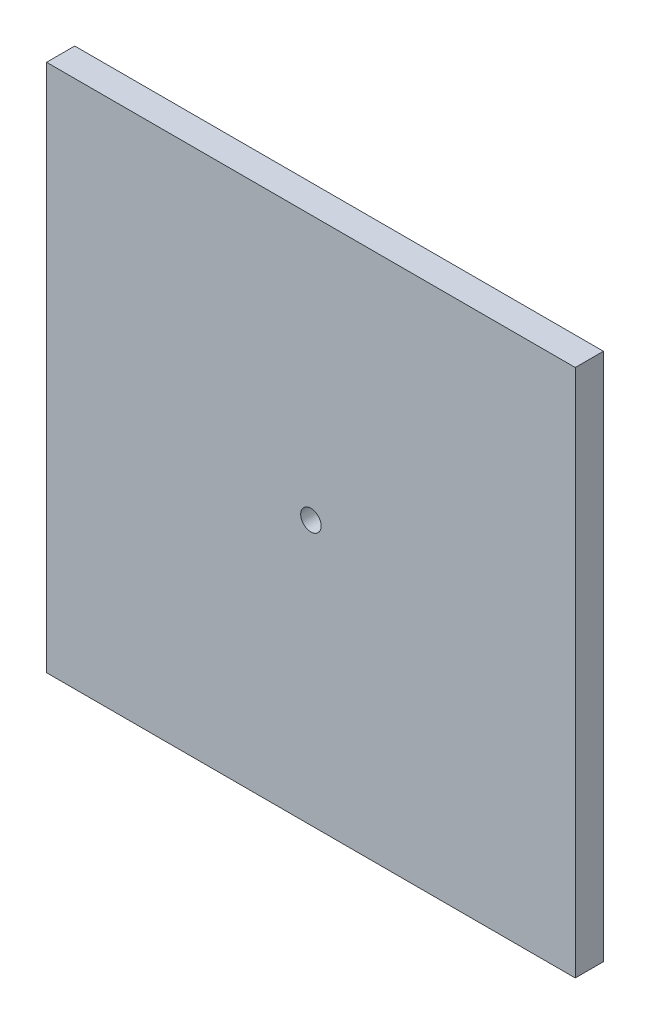
ISO-10303-21;
HEADER;
FILE_DESCRIPTION(('STEP AP214'),'2;1');
FILE_NAME('part.step','',(''),(''),'','','');
FILE_SCHEMA(('AUTOMOTIVE_DESIGN { 1 0 10303 214 1 1 1 1 }'));
ENDSEC;
DATA;
#1=APPLICATION_CONTEXT('core data for automotive mechanical design processes');
#2=APPLICATION_PROTOCOL_DEFINITION('international standard','automotive_design',2000,#1);
#3=PRODUCT_CONTEXT('',#1,'mechanical');
#4=PRODUCT('Part','Part','',(#3));
#5=PRODUCT_RELATED_PRODUCT_CATEGORY('part','',(#4));
#6=PRODUCT_DEFINITION_FORMATION('','',#4);
#7=PRODUCT_DEFINITION_CONTEXT('part definition',#1,'design');
#8=PRODUCT_DEFINITION('design','',#6,#7);
#9=PRODUCT_DEFINITION_SHAPE('','',#8);
#10=(LENGTH_UNIT() NAMED_UNIT(*) SI_UNIT(.MILLI.,.METRE.));
#11=(NAMED_UNIT(*) PLANE_ANGLE_UNIT() SI_UNIT($,.RADIAN.));
#12=(NAMED_UNIT(*) SI_UNIT($,.STERADIAN.) SOLID_ANGLE_UNIT());
#13=UNCERTAINTY_MEASURE_WITH_UNIT(LENGTH_MEASURE(1.E-05),#10,'distance_accuracy_value','');
#14=(GEOMETRIC_REPRESENTATION_CONTEXT(3) GLOBAL_UNCERTAINTY_ASSIGNED_CONTEXT((#13)) GLOBAL_UNIT_ASSIGNED_CONTEXT((#10,
#11,#12)) REPRESENTATION_CONTEXT('',''));
#15=CARTESIAN_POINT('',(0.,0.,0.));
#16=DIRECTION('',(0.,0.,1.));
#17=DIRECTION('',(1.,0.,0.));
#18=AXIS2_PLACEMENT_3D('',#15,#16,#17);
#19=CARTESIAN_POINT('',(81.9785,0.,8.73125));
#20=DIRECTION('',(1.,0.,0.));
#21=DIRECTION('',(0.,1.,0.));
#22=AXIS2_PLACEMENT_3D('',#19,#20,#21);
#23=PLANE('',#22);
#24=DIRECTION('',(0.,-1.,0.));
#25=VECTOR('',#24,1.);
#26=CARTESIAN_POINT('',(81.9785,0.,0.));
#27=LINE('',#26,#25);
#28=CARTESIAN_POINT('',(81.9785,81.9785,0.));
#29=VERTEX_POINT('',#28);
#30=CARTESIAN_POINT('',(81.9785,-81.9785,0.));
#31=VERTEX_POINT('',#30);
#32=EDGE_CURVE('E120',#29,#31,#27,.T.);
#33=ORIENTED_EDGE('',*,*,#32,.F.);
#34=DIRECTION('',(0.,0.,-1.));
#35=VECTOR('',#34,1.);
#36=CARTESIAN_POINT('',(81.9785,81.9785,8.73125));
#37=LINE('',#36,#35);
#38=CARTESIAN_POINT('',(81.9785,81.9785,8.73125));
#39=VERTEX_POINT('',#38);
#40=EDGE_CURVE('E11',#39,#29,#37,.T.);
#41=ORIENTED_EDGE('',*,*,#40,.F.);
#42=DIRECTION('',(0.,-1.,0.));
#43=VECTOR('',#42,1.);
#44=CARTESIAN_POINT('',(81.9785,0.,8.73125));
#45=LINE('',#44,#43);
#46=CARTESIAN_POINT('',(81.9785,-81.9785,8.73125));
#47=VERTEX_POINT('',#46);
#48=EDGE_CURVE('E106',#39,#47,#45,.T.);
#49=ORIENTED_EDGE('',*,*,#48,.T.);
#50=DIRECTION('',(0.,0.,-1.));
#51=VECTOR('',#50,1.);
#52=CARTESIAN_POINT('',(81.9785,-81.9785,8.73125));
#53=LINE('',#52,#51);
#54=EDGE_CURVE('E84',#47,#31,#53,.T.);
#55=ORIENTED_EDGE('',*,*,#54,.T.);
#56=EDGE_LOOP('',(#33,#41,#49,#55));
#57=FACE_BOUND('',#56,.T.);
#58=ADVANCED_FACE('F45',(#57),#23,.T.);
#59=CARTESIAN_POINT('',(0.,81.9785,8.73125));
#60=DIRECTION('',(0.,1.,0.));
#61=DIRECTION('',(0.,0.,1.));
#62=AXIS2_PLACEMENT_3D('',#59,#60,#61);
#63=PLANE('',#62);
#64=DIRECTION('',(1.,0.,0.));
#65=VECTOR('',#64,1.);
#66=CARTESIAN_POINT('',(0.,81.9785,0.));
#67=LINE('',#66,#65);
#68=CARTESIAN_POINT('',(-81.9785,81.9785,0.));
#69=VERTEX_POINT('',#68);
#70=EDGE_CURVE('E97',#69,#29,#67,.T.);
#71=ORIENTED_EDGE('',*,*,#70,.F.);
#72=DIRECTION('',(0.,0.,-1.));
#73=VECTOR('',#72,1.);
#74=CARTESIAN_POINT('',(-81.9785,81.9785,8.73125));
#75=LINE('',#74,#73);
#76=CARTESIAN_POINT('',(-81.9785,81.9785,8.73125));
#77=VERTEX_POINT('',#76);
#78=EDGE_CURVE('E54',#77,#69,#75,.T.);
#79=ORIENTED_EDGE('',*,*,#78,.F.);
#80=DIRECTION('',(1.,0.,0.));
#81=VECTOR('',#80,1.);
#82=CARTESIAN_POINT('',(0.,81.9785,8.73125));
#83=LINE('',#82,#81);
#84=EDGE_CURVE('E95',#77,#39,#83,.T.);
#85=ORIENTED_EDGE('',*,*,#84,.T.);
#86=ORIENTED_EDGE('',*,*,#40,.T.);
#87=EDGE_LOOP('',(#71,#79,#85,#86));
#88=FACE_BOUND('',#87,.T.);
#89=ADVANCED_FACE('F93',(#88),#63,.T.);
#90=CARTESIAN_POINT('',(-81.9785000000003,2.70616862252383E-13,8.73125));
#91=DIRECTION('',(1.,0.,0.));
#92=DIRECTION('',(0.,1.,0.));
#93=AXIS2_PLACEMENT_3D('',#90,#91,#92);
#94=PLANE('',#93);
#95=DIRECTION('',(0.,-1.,0.));
#96=VECTOR('',#95,1.);
#97=CARTESIAN_POINT('',(-81.9785000000003,2.70616862252383E-13,0.));
#98=LINE('',#97,#96);
#99=CARTESIAN_POINT('',(-81.9785000000005,-81.9785,0.));
#100=VERTEX_POINT('',#99);
#101=EDGE_CURVE('E77',#69,#100,#98,.T.);
#102=ORIENTED_EDGE('',*,*,#101,.T.);
#103=DIRECTION('',(0.,0.,-1.));
#104=VECTOR('',#103,1.);
#105=CARTESIAN_POINT('',(-81.9785000000005,-81.9785,8.73125));
#106=LINE('',#105,#104);
#107=CARTESIAN_POINT('',(-81.9785000000005,-81.9785,8.73125));
#108=VERTEX_POINT('',#107);
#109=EDGE_CURVE('E99',#108,#100,#106,.T.);
#110=ORIENTED_EDGE('',*,*,#109,.F.);
#111=DIRECTION('',(0.,-1.,0.));
#112=VECTOR('',#111,1.);
#113=CARTESIAN_POINT('',(-81.9785000000003,2.70616862252383E-13,8.73125));
#114=LINE('',#113,#112);
#115=EDGE_CURVE('E100',#77,#108,#114,.T.);
#116=ORIENTED_EDGE('',*,*,#115,.F.);
#117=ORIENTED_EDGE('',*,*,#78,.T.);
#118=EDGE_LOOP('',(#102,#110,#116,#117));
#119=FACE_BOUND('',#118,.T.);
#120=ADVANCED_FACE('F101',(#119),#94,.F.);
#121=CARTESIAN_POINT('',(0.,-81.9785,8.73125));
#122=DIRECTION('',(0.,1.,0.));
#123=DIRECTION('',(0.,0.,1.));
#124=AXIS2_PLACEMENT_3D('',#121,#122,#123);
#125=PLANE('',#124);
#126=DIRECTION('',(1.,0.,0.));
#127=VECTOR('',#126,1.);
#128=CARTESIAN_POINT('',(0.,-81.9785,0.));
#129=LINE('',#128,#127);
#130=EDGE_CURVE('E129',#100,#31,#129,.T.);
#131=ORIENTED_EDGE('',*,*,#130,.T.);
#132=ORIENTED_EDGE('',*,*,#54,.F.);
#133=DIRECTION('',(1.,0.,0.));
#134=VECTOR('',#133,1.);
#135=CARTESIAN_POINT('',(0.,-81.9785,8.73125));
#136=LINE('',#135,#134);
#137=EDGE_CURVE('E62',#108,#47,#136,.T.);
#138=ORIENTED_EDGE('',*,*,#137,.F.);
#139=ORIENTED_EDGE('',*,*,#109,.T.);
#140=EDGE_LOOP('',(#131,#132,#138,#139));
#141=FACE_BOUND('',#140,.T.);
#142=ADVANCED_FACE('F140',(#141),#125,.F.);
#143=CARTESIAN_POINT('',(0.,0.,8.73125));
#144=DIRECTION('',(0.,0.,-1.));
#145=DIRECTION('',(-1.,0.,0.));
#146=AXIS2_PLACEMENT_3D('',#143,#144,#145);
#147=CYLINDRICAL_SURFACE('',#146,3.175);
#148=CARTESIAN_POINT('',(0.,0.,8.73125));
#149=DIRECTION('',(0.,0.,1.));
#150=DIRECTION('',(1.,0.,0.));
#151=AXIS2_PLACEMENT_3D('',#148,#149,#150);
#152=CIRCLE('',#151,3.175);
#153=CARTESIAN_POINT('',(3.175,0.,8.73125));
#154=VERTEX_POINT('',#153);
#155=EDGE_CURVE('E116',#154,#154,#152,.T.);
#156=ORIENTED_EDGE('',*,*,#155,.T.);
#157=EDGE_LOOP('',(#156));
#158=FACE_BOUND('',#157,.T.);
#159=CARTESIAN_POINT('',(0.,0.,0.));
#160=DIRECTION('',(0.,0.,1.));
#161=DIRECTION('',(1.,0.,0.));
#162=AXIS2_PLACEMENT_3D('',#159,#160,#161);
#163=CIRCLE('',#162,3.175);
#164=CARTESIAN_POINT('',(3.175,0.,0.));
#165=VERTEX_POINT('',#164);
#166=EDGE_CURVE('E110',#165,#165,#163,.T.);
#167=ORIENTED_EDGE('',*,*,#166,.F.);
#168=EDGE_LOOP('',(#167));
#169=FACE_BOUND('',#168,.T.);
#170=ADVANCED_FACE('F155',(#158,#169),#147,.F.);
#171=CARTESIAN_POINT('',(0.,0.,8.73125));
#172=DIRECTION('',(0.,0.,1.));
#173=DIRECTION('',(1.,0.,0.));
#174=AXIS2_PLACEMENT_3D('',#171,#172,#173);
#175=PLANE('',#174);
#176=ORIENTED_EDGE('',*,*,#48,.F.);
#177=ORIENTED_EDGE('',*,*,#84,.F.);
#178=ORIENTED_EDGE('',*,*,#115,.T.);
#179=ORIENTED_EDGE('',*,*,#137,.T.);
#180=EDGE_LOOP('',(#176,#177,#178,#179));
#181=FACE_BOUND('',#180,.T.);
#182=ORIENTED_EDGE('',*,*,#155,.F.);
#183=EDGE_LOOP('',(#182));
#184=FACE_BOUND('',#183,.T.);
#185=ADVANCED_FACE('F104',(#181,#184),#175,.T.);
#186=CARTESIAN_POINT('',(0.,0.,0.));
#187=DIRECTION('',(0.,0.,1.));
#188=DIRECTION('',(1.,0.,0.));
#189=AXIS2_PLACEMENT_3D('',#186,#187,#188);
#190=PLANE('',#189);
#191=CARTESIAN_POINT('',(69.2785000000001,-69.2785,0.));
#192=DIRECTION('',(0.,0.,1.));
#193=DIRECTION('',(1.,0.,0.));
#194=AXIS2_PLACEMENT_3D('',#191,#192,#193);
#195=CIRCLE('',#194,3.17500000000001);
#196=CARTESIAN_POINT('',(72.4535000000001,-69.2785,0.));
#197=VERTEX_POINT('',#196);
#198=EDGE_CURVE('E202',#197,#197,#195,.T.);
#199=ORIENTED_EDGE('',*,*,#198,.T.);
#200=EDGE_LOOP('',(#199));
#201=FACE_BOUND('',#200,.T.);
#202=CARTESIAN_POINT('',(-69.2785,-69.2785000000001,0.));
#203=DIRECTION('',(0.,0.,1.));
#204=DIRECTION('',(1.,0.,0.));
#205=AXIS2_PLACEMENT_3D('',#202,#203,#204);
#206=CIRCLE('',#205,3.17499999999998);
#207=CARTESIAN_POINT('',(-66.1035,-69.2785000000001,0.));
#208=VERTEX_POINT('',#207);
#209=EDGE_CURVE('E201',#208,#208,#206,.T.);
#210=ORIENTED_EDGE('',*,*,#209,.T.);
#211=EDGE_LOOP('',(#210));
#212=FACE_BOUND('',#211,.T.);
#213=CARTESIAN_POINT('',(-69.2785,69.2785,0.));
#214=DIRECTION('',(0.,0.,1.));
#215=DIRECTION('',(1.,0.,0.));
#216=AXIS2_PLACEMENT_3D('',#213,#214,#215);
#217=CIRCLE('',#216,3.175);
#218=CARTESIAN_POINT('',(-66.1035,69.2785,0.));
#219=VERTEX_POINT('',#218);
#220=EDGE_CURVE('E214',#219,#219,#217,.T.);
#221=ORIENTED_EDGE('',*,*,#220,.T.);
#222=EDGE_LOOP('',(#221));
#223=FACE_BOUND('',#222,.T.);
#224=CARTESIAN_POINT('',(69.2785,69.2785000000001,0.));
#225=DIRECTION('',(0.,0.,1.));
#226=DIRECTION('',(1.,0.,0.));
#227=AXIS2_PLACEMENT_3D('',#224,#225,#226);
#228=CIRCLE('',#227,3.17499999999998);
#229=CARTESIAN_POINT('',(72.4535,69.2785000000001,0.));
#230=VERTEX_POINT('',#229);
#231=EDGE_CURVE('E220',#230,#230,#228,.T.);
#232=ORIENTED_EDGE('',*,*,#231,.T.);
#233=EDGE_LOOP('',(#232));
#234=FACE_BOUND('',#233,.T.);
#235=ORIENTED_EDGE('',*,*,#32,.T.);
#236=ORIENTED_EDGE('',*,*,#130,.F.);
#237=ORIENTED_EDGE('',*,*,#101,.F.);
#238=ORIENTED_EDGE('',*,*,#70,.T.);
#239=EDGE_LOOP('',(#235,#236,#237,#238));
#240=FACE_BOUND('',#239,.T.);
#241=ORIENTED_EDGE('',*,*,#166,.T.);
#242=EDGE_LOOP('',(#241));
#243=FACE_BOUND('',#242,.T.);
#244=ADVANCED_FACE('F142',(#201,#212,#223,#234,#240,#243),#190,.F.);
#245=CARTESIAN_POINT('',(69.2785,69.2785000000001,-9.398));
#246=DIRECTION('',(0.,0.,1.));
#247=DIRECTION('',(1.,0.,0.));
#248=AXIS2_PLACEMENT_3D('',#245,#246,#247);
#249=CYLINDRICAL_SURFACE('',#248,3.17499999999998);
#250=CARTESIAN_POINT('',(69.2785,69.2785000000001,-9.398));
#251=DIRECTION('',(0.,0.,1.));
#252=DIRECTION('',(1.,0.,0.));
#253=AXIS2_PLACEMENT_3D('',#250,#251,#252);
#254=CIRCLE('',#253,3.17499999999998);
#255=CARTESIAN_POINT('',(72.4535,69.2785000000001,-9.398));
#256=VERTEX_POINT('',#255);
#257=EDGE_CURVE('E124',#256,#256,#254,.T.);
#258=ORIENTED_EDGE('',*,*,#257,.T.);
#259=EDGE_LOOP('',(#258));
#260=FACE_BOUND('',#259,.T.);
#261=ORIENTED_EDGE('',*,*,#231,.F.);
#262=EDGE_LOOP('',(#261));
#263=FACE_BOUND('',#262,.T.);
#264=ADVANCED_FACE('F161',(#260,#263),#249,.T.);
#265=CARTESIAN_POINT('',(0.,0.,-9.398));
#266=DIRECTION('',(0.,0.,1.));
#267=DIRECTION('',(1.,0.,0.));
#268=AXIS2_PLACEMENT_3D('',#265,#266,#267);
#269=PLANE('',#268);
#270=ORIENTED_EDGE('',*,*,#257,.F.);
#271=EDGE_LOOP('',(#270));
#272=FACE_BOUND('',#271,.T.);
#273=ADVANCED_FACE('F167',(#272),#269,.F.);
#274=CARTESIAN_POINT('',(-69.2785,69.2785,-9.398));
#275=DIRECTION('',(0.,0.,1.));
#276=DIRECTION('',(1.,0.,0.));
#277=AXIS2_PLACEMENT_3D('',#274,#275,#276);
#278=CYLINDRICAL_SURFACE('',#277,3.175);
#279=CARTESIAN_POINT('',(-69.2785,69.2785,-9.398));
#280=DIRECTION('',(0.,0.,1.));
#281=DIRECTION('',(1.,0.,0.));
#282=AXIS2_PLACEMENT_3D('',#279,#280,#281);
#283=CIRCLE('',#282,3.175);
#284=CARTESIAN_POINT('',(-66.1035,69.2785,-9.398));
#285=VERTEX_POINT('',#284);
#286=EDGE_CURVE('E216',#285,#285,#283,.T.);
#287=ORIENTED_EDGE('',*,*,#286,.T.);
#288=EDGE_LOOP('',(#287));
#289=FACE_BOUND('',#288,.T.);
#290=ORIENTED_EDGE('',*,*,#220,.F.);
#291=EDGE_LOOP('',(#290));
#292=FACE_BOUND('',#291,.T.);
#293=ADVANCED_FACE('F171',(#289,#292),#278,.T.);
#294=CARTESIAN_POINT('',(0.,0.,-9.398));
#295=DIRECTION('',(0.,0.,1.));
#296=DIRECTION('',(1.,0.,0.));
#297=AXIS2_PLACEMENT_3D('',#294,#295,#296);
#298=PLANE('',#297);
#299=ORIENTED_EDGE('',*,*,#286,.F.);
#300=EDGE_LOOP('',(#299));
#301=FACE_BOUND('',#300,.T.);
#302=ADVANCED_FACE('F175',(#301),#298,.F.);
#303=CARTESIAN_POINT('',(-69.2785,-69.2785000000001,-9.398));
#304=DIRECTION('',(0.,0.,1.));
#305=DIRECTION('',(1.,0.,0.));
#306=AXIS2_PLACEMENT_3D('',#303,#304,#305);
#307=CYLINDRICAL_SURFACE('',#306,3.17499999999998);
#308=CARTESIAN_POINT('',(-69.2785,-69.2785000000001,-9.398));
#309=DIRECTION('',(0.,0.,1.));
#310=DIRECTION('',(1.,0.,0.));
#311=AXIS2_PLACEMENT_3D('',#308,#309,#310);
#312=CIRCLE('',#311,3.17499999999998);
#313=CARTESIAN_POINT('',(-66.1035,-69.2785000000001,-9.398));
#314=VERTEX_POINT('',#313);
#315=EDGE_CURVE('E207',#314,#314,#312,.T.);
#316=ORIENTED_EDGE('',*,*,#315,.T.);
#317=EDGE_LOOP('',(#316));
#318=FACE_BOUND('',#317,.T.);
#319=ORIENTED_EDGE('',*,*,#209,.F.);
#320=EDGE_LOOP('',(#319));
#321=FACE_BOUND('',#320,.T.);
#322=ADVANCED_FACE('F179',(#318,#321),#307,.T.);
#323=CARTESIAN_POINT('',(0.,0.,-9.398));
#324=DIRECTION('',(0.,0.,1.));
#325=DIRECTION('',(1.,0.,0.));
#326=AXIS2_PLACEMENT_3D('',#323,#324,#325);
#327=PLANE('',#326);
#328=ORIENTED_EDGE('',*,*,#315,.F.);
#329=EDGE_LOOP('',(#328));
#330=FACE_BOUND('',#329,.T.);
#331=ADVANCED_FACE('F183',(#330),#327,.F.);
#332=CARTESIAN_POINT('',(69.2785000000001,-69.2785,-9.398));
#333=DIRECTION('',(0.,0.,1.));
#334=DIRECTION('',(1.,0.,0.));
#335=AXIS2_PLACEMENT_3D('',#332,#333,#334);
#336=CYLINDRICAL_SURFACE('',#335,3.17500000000001);
#337=CARTESIAN_POINT('',(69.2785000000001,-69.2785,-9.398));
#338=DIRECTION('',(0.,0.,1.));
#339=DIRECTION('',(1.,0.,0.));
#340=AXIS2_PLACEMENT_3D('',#337,#338,#339);
#341=CIRCLE('',#340,3.17500000000001);
#342=CARTESIAN_POINT('',(72.4535000000001,-69.2785,-9.398));
#343=VERTEX_POINT('',#342);
#344=EDGE_CURVE('E199',#343,#343,#341,.T.);
#345=ORIENTED_EDGE('',*,*,#344,.T.);
#346=EDGE_LOOP('',(#345));
#347=FACE_BOUND('',#346,.T.);
#348=ORIENTED_EDGE('',*,*,#198,.F.);
#349=EDGE_LOOP('',(#348));
#350=FACE_BOUND('',#349,.T.);
#351=ADVANCED_FACE('F187',(#347,#350),#336,.T.);
#352=CARTESIAN_POINT('',(0.,0.,-9.398));
#353=DIRECTION('',(0.,0.,1.));
#354=DIRECTION('',(1.,0.,0.));
#355=AXIS2_PLACEMENT_3D('',#352,#353,#354);
#356=PLANE('',#355);
#357=ORIENTED_EDGE('',*,*,#344,.F.);
#358=EDGE_LOOP('',(#357));
#359=FACE_BOUND('',#358,.T.);
#360=ADVANCED_FACE('F191',(#359),#356,.F.);
#361=CLOSED_SHELL('',(#58,#89,#120,#142,#170,#185,#244,#264,#273,#293,#302,#322,#331,#351,#360));
#362=MANIFOLD_SOLID_BREP('B2',#361);
#363=ADVANCED_BREP_SHAPE_REPRESENTATION('',(#18,#362),#14);
#364=SHAPE_DEFINITION_REPRESENTATION(#9,#363);
ENDSEC;
END-ISO-10303-21;
